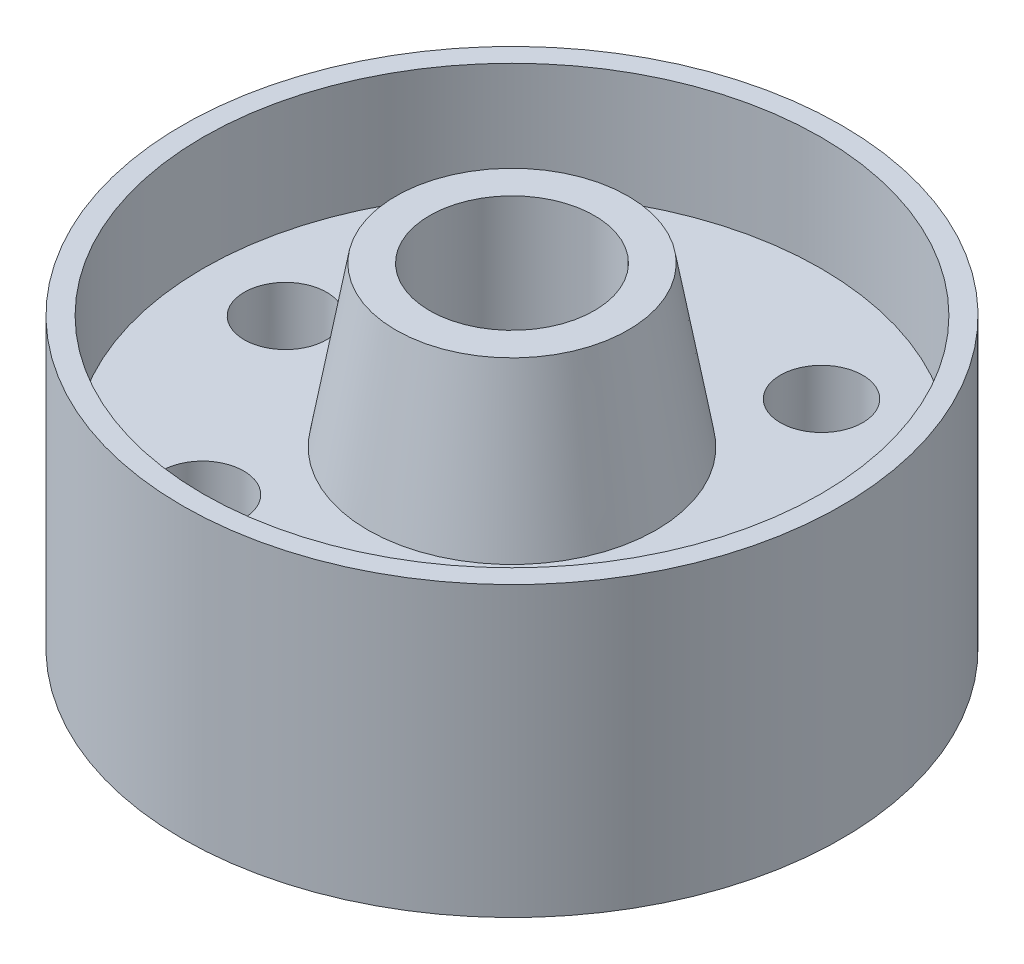
ISO-10303-21;
HEADER;
FILE_DESCRIPTION(('STEP AP214'),'2;1');
FILE_NAME('part.step','',(''),(''),'','','');
FILE_SCHEMA(('AUTOMOTIVE_DESIGN { 1 0 10303 214 1 1 1 1 }'));
ENDSEC;
DATA;
#1=APPLICATION_CONTEXT('core data for automotive mechanical design processes');
#2=APPLICATION_PROTOCOL_DEFINITION('international standard','automotive_design',2000,#1);
#3=PRODUCT_CONTEXT('',#1,'mechanical');
#4=PRODUCT('Part','Part','',(#3));
#5=PRODUCT_RELATED_PRODUCT_CATEGORY('part','',(#4));
#6=PRODUCT_DEFINITION_FORMATION('','',#4);
#7=PRODUCT_DEFINITION_CONTEXT('part definition',#1,'design');
#8=PRODUCT_DEFINITION('design','',#6,#7);
#9=PRODUCT_DEFINITION_SHAPE('','',#8);
#10=(LENGTH_UNIT() NAMED_UNIT(*) SI_UNIT(.MILLI.,.METRE.));
#11=(NAMED_UNIT(*) PLANE_ANGLE_UNIT() SI_UNIT($,.RADIAN.));
#12=(NAMED_UNIT(*) SI_UNIT($,.STERADIAN.) SOLID_ANGLE_UNIT());
#13=UNCERTAINTY_MEASURE_WITH_UNIT(LENGTH_MEASURE(1.E-05),#10,'distance_accuracy_value','');
#14=(GEOMETRIC_REPRESENTATION_CONTEXT(3) GLOBAL_UNCERTAINTY_ASSIGNED_CONTEXT((#13)) GLOBAL_UNIT_ASSIGNED_CONTEXT((#10,
#11,#12)) REPRESENTATION_CONTEXT('',''));
#15=CARTESIAN_POINT('',(0.,0.,0.));
#16=DIRECTION('',(0.,0.,1.));
#17=DIRECTION('',(1.,0.,0.));
#18=AXIS2_PLACEMENT_3D('',#15,#16,#17);
#19=CARTESIAN_POINT('',(0.,29.3497,0.));
#20=DIRECTION('',(0.,1.,0.));
#21=DIRECTION('',(0.,0.,1.));
#22=AXIS2_PLACEMENT_3D('',#19,#20,#21);
#23=CYLINDRICAL_SURFACE('',#22,12.7);
#24=CARTESIAN_POINT('',(0.,29.3497,0.));
#25=DIRECTION('',(0.,1.,0.));
#26=DIRECTION('',(0.,0.,1.));
#27=AXIS2_PLACEMENT_3D('',#24,#25,#26);
#28=CIRCLE('',#27,12.7);
#29=CARTESIAN_POINT('',(0.,29.3497,12.7));
#30=VERTEX_POINT('',#29);
#31=EDGE_CURVE('E10',#30,#30,#28,.T.);
#32=ORIENTED_EDGE('',*,*,#31,.T.);
#33=EDGE_LOOP('',(#32));
#34=FACE_BOUND('',#33,.T.);
#35=CARTESIAN_POINT('',(0.,-29.3497,0.));
#36=DIRECTION('',(0.,1.,0.));
#37=DIRECTION('',(0.,0.,1.));
#38=AXIS2_PLACEMENT_3D('',#35,#36,#37);
#39=CIRCLE('',#38,12.7);
#40=CARTESIAN_POINT('',(0.,-29.3497,12.7));
#41=VERTEX_POINT('',#40);
#42=EDGE_CURVE('E59',#41,#41,#39,.T.);
#43=ORIENTED_EDGE('',*,*,#42,.F.);
#44=EDGE_LOOP('',(#43));
#45=FACE_BOUND('',#44,.T.);
#46=ADVANCED_FACE('F37',(#34,#45),#23,.F.);
#47=CARTESIAN_POINT('',(-12.7,29.3497,0.));
#48=DIRECTION('',(0.,1.,0.));
#49=DIRECTION('',(0.,0.,1.));
#50=AXIS2_PLACEMENT_3D('',#47,#48,#49);
#51=PLANE('',#50);
#52=CARTESIAN_POINT('',(0.,29.3497,0.));
#53=DIRECTION('',(0.,1.,0.));
#54=DIRECTION('',(0.,0.,1.));
#55=AXIS2_PLACEMENT_3D('',#52,#53,#54);
#56=CIRCLE('',#55,17.9008100231998);
#57=CARTESIAN_POINT('',(0.,29.3497,17.9008100231998));
#58=VERTEX_POINT('',#57);
#59=EDGE_CURVE('E45',#58,#58,#56,.T.);
#60=ORIENTED_EDGE('',*,*,#59,.T.);
#61=EDGE_LOOP('',(#60));
#62=FACE_BOUND('',#61,.T.);
#63=ORIENTED_EDGE('',*,*,#31,.F.);
#64=EDGE_LOOP('',(#63));
#65=FACE_BOUND('',#64,.T.);
#66=ADVANCED_FACE('F156',(#62,#65),#51,.T.);
#67=CARTESIAN_POINT('',(0.,29.3497,0.));
#68=DIRECTION('',(0.,-1.,0.));
#69=DIRECTION('',(0.,0.,-1.));
#70=AXIS2_PLACEMENT_3D('',#67,#68,#69);
#71=CONICAL_SURFACE('',#70,17.9008100231998,0.174532925199433);
#72=CARTESIAN_POINT('',(0.,4.826,0.));
#73=DIRECTION('',(0.,1.,0.));
#74=DIRECTION('',(0.,0.,1.));
#75=AXIS2_PLACEMENT_3D('',#72,#73,#74);
#76=CIRCLE('',#75,22.225);
#77=CARTESIAN_POINT('',(0.,4.826,22.225));
#78=VERTEX_POINT('',#77);
#79=EDGE_CURVE('E51',#78,#78,#76,.T.);
#80=ORIENTED_EDGE('',*,*,#79,.T.);
#81=EDGE_LOOP('',(#80));
#82=FACE_BOUND('',#81,.T.);
#83=ORIENTED_EDGE('',*,*,#59,.F.);
#84=EDGE_LOOP('',(#83));
#85=FACE_BOUND('',#84,.T.);
#86=ADVANCED_FACE('F141',(#82,#85),#71,.T.);
#87=CARTESIAN_POINT('',(-22.225,4.826,0.));
#88=DIRECTION('',(0.,1.,0.));
#89=DIRECTION('',(0.,0.,1.));
#90=AXIS2_PLACEMENT_3D('',#87,#88,#89);
#91=PLANE('',#90);
#92=CARTESIAN_POINT('',(-17.4625,4.826,-30.2459372271715));
#93=DIRECTION('',(0.,1.,0.));
#94=DIRECTION('',(0.,0.,1.));
#95=AXIS2_PLACEMENT_3D('',#92,#93,#94);
#96=CIRCLE('',#95,6.34999999999999);
#97=CARTESIAN_POINT('',(-17.4625,4.826,-23.8959372271715));
#98=VERTEX_POINT('',#97);
#99=EDGE_CURVE('E91',#98,#98,#96,.T.);
#100=ORIENTED_EDGE('',*,*,#99,.F.);
#101=EDGE_LOOP('',(#100));
#102=FACE_BOUND('',#101,.T.);
#103=CARTESIAN_POINT('',(17.4625,4.826,-30.2459372271715));
#104=DIRECTION('',(0.,1.,0.));
#105=DIRECTION('',(0.,0.,1.));
#106=AXIS2_PLACEMENT_3D('',#103,#104,#105);
#107=CIRCLE('',#106,6.34999999999999);
#108=CARTESIAN_POINT('',(17.4625,4.826,-23.8959372271715));
#109=VERTEX_POINT('',#108);
#110=EDGE_CURVE('E78',#109,#109,#107,.T.);
#111=ORIENTED_EDGE('',*,*,#110,.F.);
#112=EDGE_LOOP('',(#111));
#113=FACE_BOUND('',#112,.T.);
#114=CARTESIAN_POINT('',(-34.925,4.826,0.));
#115=DIRECTION('',(0.,1.,0.));
#116=DIRECTION('',(0.,0.,1.));
#117=AXIS2_PLACEMENT_3D('',#114,#115,#116);
#118=CIRCLE('',#117,6.34999999999999);
#119=CARTESIAN_POINT('',(-34.925,4.826,6.34999999999999));
#120=VERTEX_POINT('',#119);
#121=EDGE_CURVE('E74',#120,#120,#118,.T.);
#122=ORIENTED_EDGE('',*,*,#121,.F.);
#123=EDGE_LOOP('',(#122));
#124=FACE_BOUND('',#123,.T.);
#125=CARTESIAN_POINT('',(34.925,4.826,0.));
#126=DIRECTION('',(0.,1.,0.));
#127=DIRECTION('',(0.,0.,1.));
#128=AXIS2_PLACEMENT_3D('',#125,#126,#127);
#129=CIRCLE('',#128,6.34999999999999);
#130=CARTESIAN_POINT('',(34.925,4.826,6.34999999999999));
#131=VERTEX_POINT('',#130);
#132=EDGE_CURVE('E70',#131,#131,#129,.T.);
#133=ORIENTED_EDGE('',*,*,#132,.F.);
#134=EDGE_LOOP('',(#133));
#135=FACE_BOUND('',#134,.T.);
#136=CARTESIAN_POINT('',(-17.4625,4.826,30.2459372271715));
#137=DIRECTION('',(0.,1.,0.));
#138=DIRECTION('',(0.,0.,1.));
#139=AXIS2_PLACEMENT_3D('',#136,#137,#138);
#140=CIRCLE('',#139,6.34999999999999);
#141=CARTESIAN_POINT('',(-17.4625,4.826,36.5959372271715));
#142=VERTEX_POINT('',#141);
#143=EDGE_CURVE('E65',#142,#142,#140,.T.);
#144=ORIENTED_EDGE('',*,*,#143,.F.);
#145=EDGE_LOOP('',(#144));
#146=FACE_BOUND('',#145,.T.);
#147=CARTESIAN_POINT('',(17.4625,4.826,30.2459372271715));
#148=DIRECTION('',(0.,1.,0.));
#149=DIRECTION('',(0.,0.,1.));
#150=AXIS2_PLACEMENT_3D('',#147,#148,#149);
#151=CIRCLE('',#150,6.34999999999999);
#152=CARTESIAN_POINT('',(17.4625,4.826,36.5959372271715));
#153=VERTEX_POINT('',#152);
#154=EDGE_CURVE('E60',#153,#153,#151,.T.);
#155=ORIENTED_EDGE('',*,*,#154,.F.);
#156=EDGE_LOOP('',(#155));
#157=FACE_BOUND('',#156,.T.);
#158=CARTESIAN_POINT('',(0.,4.826,0.));
#159=DIRECTION('',(0.,1.,0.));
#160=DIRECTION('',(0.,0.,1.));
#161=AXIS2_PLACEMENT_3D('',#158,#159,#160);
#162=CIRCLE('',#161,47.625);
#163=CARTESIAN_POINT('',(0.,4.826,47.625));
#164=VERTEX_POINT('',#163);
#165=EDGE_CURVE('E134',#164,#164,#162,.T.);
#166=ORIENTED_EDGE('',*,*,#165,.T.);
#167=EDGE_LOOP('',(#166));
#168=FACE_BOUND('',#167,.T.);
#169=ORIENTED_EDGE('',*,*,#79,.F.);
#170=EDGE_LOOP('',(#169));
#171=FACE_BOUND('',#170,.T.);
#172=ADVANCED_FACE('F144',(#102,#113,#124,#135,#146,#157,#168,#171),#91,.T.);
#173=CARTESIAN_POINT('',(0.,29.3497,0.));
#174=DIRECTION('',(0.,1.,0.));
#175=DIRECTION('',(0.,0.,1.));
#176=AXIS2_PLACEMENT_3D('',#173,#174,#175);
#177=CYLINDRICAL_SURFACE('',#176,47.625);
#178=CARTESIAN_POINT('',(0.,22.352,0.));
#179=DIRECTION('',(0.,1.,0.));
#180=DIRECTION('',(0.,0.,1.));
#181=AXIS2_PLACEMENT_3D('',#178,#179,#180);
#182=CIRCLE('',#181,47.625);
#183=CARTESIAN_POINT('',(0.,22.352,47.625));
#184=VERTEX_POINT('',#183);
#185=EDGE_CURVE('E130',#184,#184,#182,.T.);
#186=ORIENTED_EDGE('',*,*,#185,.T.);
#187=EDGE_LOOP('',(#186));
#188=FACE_BOUND('',#187,.T.);
#189=ORIENTED_EDGE('',*,*,#165,.F.);
#190=EDGE_LOOP('',(#189));
#191=FACE_BOUND('',#190,.T.);
#192=ADVANCED_FACE('F146',(#188,#191),#177,.F.);
#193=CARTESIAN_POINT('',(-47.625,22.352,0.));
#194=DIRECTION('',(0.,1.,0.));
#195=DIRECTION('',(0.,0.,1.));
#196=AXIS2_PLACEMENT_3D('',#193,#194,#195);
#197=PLANE('',#196);
#198=CARTESIAN_POINT('',(0.,22.352,0.));
#199=DIRECTION('',(0.,1.,0.));
#200=DIRECTION('',(0.,0.,1.));
#201=AXIS2_PLACEMENT_3D('',#198,#199,#200);
#202=CIRCLE('',#201,50.8);
#203=CARTESIAN_POINT('',(0.,22.352,50.8));
#204=VERTEX_POINT('',#203);
#205=EDGE_CURVE('E126',#204,#204,#202,.T.);
#206=ORIENTED_EDGE('',*,*,#205,.T.);
#207=EDGE_LOOP('',(#206));
#208=FACE_BOUND('',#207,.T.);
#209=ORIENTED_EDGE('',*,*,#185,.F.);
#210=EDGE_LOOP('',(#209));
#211=FACE_BOUND('',#210,.T.);
#212=ADVANCED_FACE('F153',(#208,#211),#197,.T.);
#213=CARTESIAN_POINT('',(0.,29.3497,0.));
#214=DIRECTION('',(0.,1.,0.));
#215=DIRECTION('',(0.,0.,1.));
#216=AXIS2_PLACEMENT_3D('',#213,#214,#215);
#217=CYLINDRICAL_SURFACE('',#216,50.8);
#218=CARTESIAN_POINT('',(0.,-22.098,0.));
#219=DIRECTION('',(0.,1.,0.));
#220=DIRECTION('',(0.,0.,1.));
#221=AXIS2_PLACEMENT_3D('',#218,#219,#220);
#222=CIRCLE('',#221,50.8);
#223=CARTESIAN_POINT('',(0.,-22.098,50.8));
#224=VERTEX_POINT('',#223);
#225=EDGE_CURVE('E122',#224,#224,#222,.T.);
#226=ORIENTED_EDGE('',*,*,#225,.T.);
#227=EDGE_LOOP('',(#226));
#228=FACE_BOUND('',#227,.T.);
#229=ORIENTED_EDGE('',*,*,#205,.F.);
#230=EDGE_LOOP('',(#229));
#231=FACE_BOUND('',#230,.T.);
#232=ADVANCED_FACE('F197',(#228,#231),#217,.T.);
#233=CARTESIAN_POINT('',(-50.8,-22.098,0.));
#234=DIRECTION('',(0.,-1.,0.));
#235=DIRECTION('',(0.,0.,-1.));
#236=AXIS2_PLACEMENT_3D('',#233,#234,#235);
#237=PLANE('',#236);
#238=CARTESIAN_POINT('',(0.,-22.098,0.));
#239=DIRECTION('',(0.,1.,0.));
#240=DIRECTION('',(0.,0.,1.));
#241=AXIS2_PLACEMENT_3D('',#238,#239,#240);
#242=CIRCLE('',#241,47.625);
#243=CARTESIAN_POINT('',(0.,-22.098,47.625));
#244=VERTEX_POINT('',#243);
#245=EDGE_CURVE('E118',#244,#244,#242,.T.);
#246=ORIENTED_EDGE('',*,*,#245,.T.);
#247=EDGE_LOOP('',(#246));
#248=FACE_BOUND('',#247,.T.);
#249=ORIENTED_EDGE('',*,*,#225,.F.);
#250=EDGE_LOOP('',(#249));
#251=FACE_BOUND('',#250,.T.);
#252=ADVANCED_FACE('F191',(#248,#251),#237,.T.);
#253=CARTESIAN_POINT('',(0.,29.3497,0.));
#254=DIRECTION('',(0.,1.,0.));
#255=DIRECTION('',(0.,0.,1.));
#256=AXIS2_PLACEMENT_3D('',#253,#254,#255);
#257=CYLINDRICAL_SURFACE('',#256,47.625);
#258=CARTESIAN_POINT('',(0.,-4.826,0.));
#259=DIRECTION('',(0.,1.,0.));
#260=DIRECTION('',(0.,0.,1.));
#261=AXIS2_PLACEMENT_3D('',#258,#259,#260);
#262=CIRCLE('',#261,47.625);
#263=CARTESIAN_POINT('',(0.,-4.826,47.625));
#264=VERTEX_POINT('',#263);
#265=EDGE_CURVE('E114',#264,#264,#262,.T.);
#266=ORIENTED_EDGE('',*,*,#265,.T.);
#267=EDGE_LOOP('',(#266));
#268=FACE_BOUND('',#267,.T.);
#269=ORIENTED_EDGE('',*,*,#245,.F.);
#270=EDGE_LOOP('',(#269));
#271=FACE_BOUND('',#270,.T.);
#272=ADVANCED_FACE('F184',(#268,#271),#257,.F.);
#273=CARTESIAN_POINT('',(-47.625,-4.826,0.));
#274=DIRECTION('',(0.,-1.,0.));
#275=DIRECTION('',(0.,0.,-1.));
#276=AXIS2_PLACEMENT_3D('',#273,#274,#275);
#277=PLANE('',#276);
#278=CARTESIAN_POINT('',(-17.4625,-4.826,-30.2459372271715));
#279=DIRECTION('',(0.,-1.,0.));
#280=DIRECTION('',(0.,0.,-1.));
#281=AXIS2_PLACEMENT_3D('',#278,#279,#280);
#282=CIRCLE('',#281,6.34999999999999);
#283=CARTESIAN_POINT('',(-17.4625,-4.826,-36.5959372271715));
#284=VERTEX_POINT('',#283);
#285=EDGE_CURVE('E40',#284,#284,#282,.T.);
#286=ORIENTED_EDGE('',*,*,#285,.F.);
#287=EDGE_LOOP('',(#286));
#288=FACE_BOUND('',#287,.T.);
#289=CARTESIAN_POINT('',(17.4625,-4.826,-30.2459372271715));
#290=DIRECTION('',(0.,-1.,0.));
#291=DIRECTION('',(0.,0.,-1.));
#292=AXIS2_PLACEMENT_3D('',#289,#290,#291);
#293=CIRCLE('',#292,6.34999999999999);
#294=CARTESIAN_POINT('',(17.4625,-4.826,-36.5959372271715));
#295=VERTEX_POINT('',#294);
#296=EDGE_CURVE('E75',#295,#295,#293,.T.);
#297=ORIENTED_EDGE('',*,*,#296,.F.);
#298=EDGE_LOOP('',(#297));
#299=FACE_BOUND('',#298,.T.);
#300=CARTESIAN_POINT('',(-34.925,-4.826,0.));
#301=DIRECTION('',(0.,-1.,0.));
#302=DIRECTION('',(0.,0.,-1.));
#303=AXIS2_PLACEMENT_3D('',#300,#301,#302);
#304=CIRCLE('',#303,6.34999999999999);
#305=CARTESIAN_POINT('',(-34.925,-4.826,-6.34999999999999));
#306=VERTEX_POINT('',#305);
#307=EDGE_CURVE('E71',#306,#306,#304,.T.);
#308=ORIENTED_EDGE('',*,*,#307,.F.);
#309=EDGE_LOOP('',(#308));
#310=FACE_BOUND('',#309,.T.);
#311=CARTESIAN_POINT('',(34.925,-4.826,0.));
#312=DIRECTION('',(0.,-1.,0.));
#313=DIRECTION('',(0.,0.,-1.));
#314=AXIS2_PLACEMENT_3D('',#311,#312,#313);
#315=CIRCLE('',#314,6.34999999999999);
#316=CARTESIAN_POINT('',(34.925,-4.826,-6.34999999999999));
#317=VERTEX_POINT('',#316);
#318=EDGE_CURVE('E66',#317,#317,#315,.T.);
#319=ORIENTED_EDGE('',*,*,#318,.F.);
#320=EDGE_LOOP('',(#319));
#321=FACE_BOUND('',#320,.T.);
#322=CARTESIAN_POINT('',(-17.4625,-4.826,30.2459372271715));
#323=DIRECTION('',(0.,-1.,0.));
#324=DIRECTION('',(0.,0.,-1.));
#325=AXIS2_PLACEMENT_3D('',#322,#323,#324);
#326=CIRCLE('',#325,6.34999999999999);
#327=CARTESIAN_POINT('',(-17.4625,-4.826,23.8959372271715));
#328=VERTEX_POINT('',#327);
#329=EDGE_CURVE('E61',#328,#328,#326,.T.);
#330=ORIENTED_EDGE('',*,*,#329,.F.);
#331=EDGE_LOOP('',(#330));
#332=FACE_BOUND('',#331,.T.);
#333=CARTESIAN_POINT('',(17.4625,-4.826,30.2459372271715));
#334=DIRECTION('',(0.,-1.,0.));
#335=DIRECTION('',(0.,0.,-1.));
#336=AXIS2_PLACEMENT_3D('',#333,#334,#335);
#337=CIRCLE('',#336,6.34999999999999);
#338=CARTESIAN_POINT('',(17.4625,-4.826,23.8959372271715));
#339=VERTEX_POINT('',#338);
#340=EDGE_CURVE('E55',#339,#339,#337,.T.);
#341=ORIENTED_EDGE('',*,*,#340,.F.);
#342=EDGE_LOOP('',(#341));
#343=FACE_BOUND('',#342,.T.);
#344=CARTESIAN_POINT('',(0.,-4.826,0.));
#345=DIRECTION('',(0.,1.,0.));
#346=DIRECTION('',(0.,0.,1.));
#347=AXIS2_PLACEMENT_3D('',#344,#345,#346);
#348=CIRCLE('',#347,22.225);
#349=CARTESIAN_POINT('',(0.,-4.826,22.225));
#350=VERTEX_POINT('',#349);
#351=EDGE_CURVE('E110',#350,#350,#348,.T.);
#352=ORIENTED_EDGE('',*,*,#351,.T.);
#353=EDGE_LOOP('',(#352));
#354=FACE_BOUND('',#353,.T.);
#355=ORIENTED_EDGE('',*,*,#265,.F.);
#356=EDGE_LOOP('',(#355));
#357=FACE_BOUND('',#356,.T.);
#358=ADVANCED_FACE('F178',(#288,#299,#310,#321,#332,#343,#354,#357),#277,.T.);
#359=CARTESIAN_POINT('',(0.,-4.826,0.));
#360=DIRECTION('',(0.,1.,0.));
#361=DIRECTION('',(0.,0.,1.));
#362=AXIS2_PLACEMENT_3D('',#359,#360,#361);
#363=CONICAL_SURFACE('',#362,22.225,0.174532925199434);
#364=CARTESIAN_POINT('',(0.,-29.3497,0.));
#365=DIRECTION('',(0.,1.,0.));
#366=DIRECTION('',(0.,0.,1.));
#367=AXIS2_PLACEMENT_3D('',#364,#365,#366);
#368=CIRCLE('',#367,17.9008100231998);
#369=CARTESIAN_POINT('',(0.,-29.3497,17.9008100231998));
#370=VERTEX_POINT('',#369);
#371=EDGE_CURVE('E106',#370,#370,#368,.T.);
#372=ORIENTED_EDGE('',*,*,#371,.T.);
#373=EDGE_LOOP('',(#372));
#374=FACE_BOUND('',#373,.T.);
#375=ORIENTED_EDGE('',*,*,#351,.F.);
#376=EDGE_LOOP('',(#375));
#377=FACE_BOUND('',#376,.T.);
#378=ADVANCED_FACE('F172',(#374,#377),#363,.T.);
#379=CARTESIAN_POINT('',(-17.9008100231998,-29.3497,0.));
#380=DIRECTION('',(0.,-1.,0.));
#381=DIRECTION('',(0.,0.,-1.));
#382=AXIS2_PLACEMENT_3D('',#379,#380,#381);
#383=PLANE('',#382);
#384=ORIENTED_EDGE('',*,*,#42,.T.);
#385=EDGE_LOOP('',(#384));
#386=FACE_BOUND('',#385,.T.);
#387=ORIENTED_EDGE('',*,*,#371,.F.);
#388=EDGE_LOOP('',(#387));
#389=FACE_BOUND('',#388,.T.);
#390=ADVANCED_FACE('F168',(#386,#389),#383,.T.);
#391=CARTESIAN_POINT('',(17.4625,4.826,30.2459372271715));
#392=DIRECTION('',(0.,1.,0.));
#393=DIRECTION('',(0.,0.,1.));
#394=AXIS2_PLACEMENT_3D('',#391,#392,#393);
#395=CYLINDRICAL_SURFACE('',#394,6.34999999999999);
#396=ORIENTED_EDGE('',*,*,#340,.T.);
#397=EDGE_LOOP('',(#396));
#398=FACE_BOUND('',#397,.T.);
#399=ORIENTED_EDGE('',*,*,#154,.T.);
#400=EDGE_LOOP('',(#399));
#401=FACE_BOUND('',#400,.T.);
#402=ADVANCED_FACE('F171',(#398,#401),#395,.F.);
#403=CARTESIAN_POINT('',(-17.4625,4.826,30.2459372271715));
#404=DIRECTION('',(0.,1.,0.));
#405=DIRECTION('',(0.,0.,1.));
#406=AXIS2_PLACEMENT_3D('',#403,#404,#405);
#407=CYLINDRICAL_SURFACE('',#406,6.34999999999999);
#408=ORIENTED_EDGE('',*,*,#329,.T.);
#409=EDGE_LOOP('',(#408));
#410=FACE_BOUND('',#409,.T.);
#411=ORIENTED_EDGE('',*,*,#143,.T.);
#412=EDGE_LOOP('',(#411));
#413=FACE_BOUND('',#412,.T.);
#414=ADVANCED_FACE('F218',(#410,#413),#407,.F.);
#415=CARTESIAN_POINT('',(34.925,4.826,0.));
#416=DIRECTION('',(0.,1.,0.));
#417=DIRECTION('',(0.,0.,1.));
#418=AXIS2_PLACEMENT_3D('',#415,#416,#417);
#419=CYLINDRICAL_SURFACE('',#418,6.34999999999999);
#420=ORIENTED_EDGE('',*,*,#318,.T.);
#421=EDGE_LOOP('',(#420));
#422=FACE_BOUND('',#421,.T.);
#423=ORIENTED_EDGE('',*,*,#132,.T.);
#424=EDGE_LOOP('',(#423));
#425=FACE_BOUND('',#424,.T.);
#426=ADVANCED_FACE('F222',(#422,#425),#419,.F.);
#427=CARTESIAN_POINT('',(-34.925,4.826,0.));
#428=DIRECTION('',(0.,1.,0.));
#429=DIRECTION('',(0.,0.,1.));
#430=AXIS2_PLACEMENT_3D('',#427,#428,#429);
#431=CYLINDRICAL_SURFACE('',#430,6.34999999999999);
#432=ORIENTED_EDGE('',*,*,#307,.T.);
#433=EDGE_LOOP('',(#432));
#434=FACE_BOUND('',#433,.T.);
#435=ORIENTED_EDGE('',*,*,#121,.T.);
#436=EDGE_LOOP('',(#435));
#437=FACE_BOUND('',#436,.T.);
#438=ADVANCED_FACE('F226',(#434,#437),#431,.F.);
#439=CARTESIAN_POINT('',(17.4625,4.826,-30.2459372271715));
#440=DIRECTION('',(0.,1.,0.));
#441=DIRECTION('',(0.,0.,1.));
#442=AXIS2_PLACEMENT_3D('',#439,#440,#441);
#443=CYLINDRICAL_SURFACE('',#442,6.34999999999999);
#444=ORIENTED_EDGE('',*,*,#296,.T.);
#445=EDGE_LOOP('',(#444));
#446=FACE_BOUND('',#445,.T.);
#447=ORIENTED_EDGE('',*,*,#110,.T.);
#448=EDGE_LOOP('',(#447));
#449=FACE_BOUND('',#448,.T.);
#450=ADVANCED_FACE('F230',(#446,#449),#443,.F.);
#451=CARTESIAN_POINT('',(-17.4625,4.826,-30.2459372271715));
#452=DIRECTION('',(0.,1.,0.));
#453=DIRECTION('',(0.,0.,1.));
#454=AXIS2_PLACEMENT_3D('',#451,#452,#453);
#455=CYLINDRICAL_SURFACE('',#454,6.34999999999999);
#456=ORIENTED_EDGE('',*,*,#285,.T.);
#457=EDGE_LOOP('',(#456));
#458=FACE_BOUND('',#457,.T.);
#459=ORIENTED_EDGE('',*,*,#99,.T.);
#460=EDGE_LOOP('',(#459));
#461=FACE_BOUND('',#460,.T.);
#462=ADVANCED_FACE('F234',(#458,#461),#455,.F.);
#463=CLOSED_SHELL('',(#46,#66,#86,#172,#192,#212,#232,#252,#272,#358,#378,#390,#402,#414,#426,
#438,#450,#462));
#464=MANIFOLD_SOLID_BREP('B2',#463);
#465=ADVANCED_BREP_SHAPE_REPRESENTATION('',(#18,#464),#14);
#466=SHAPE_DEFINITION_REPRESENTATION(#9,#465);
ENDSEC;
END-ISO-10303-21;
